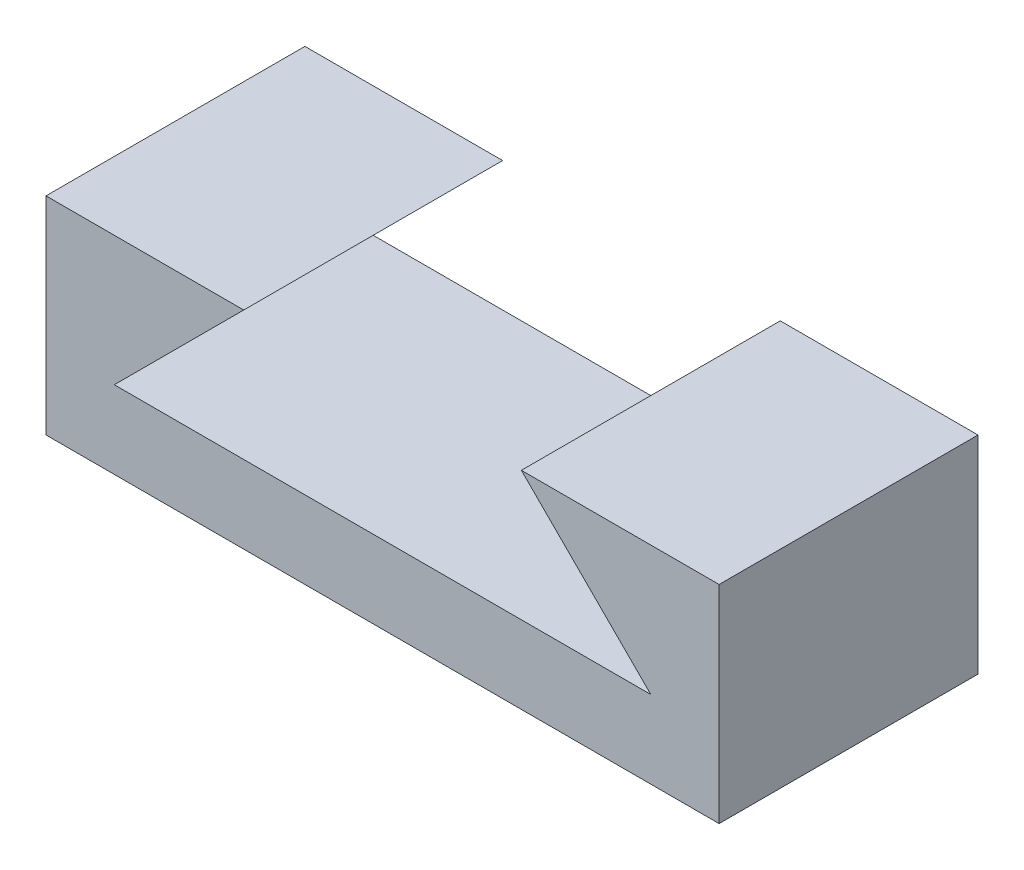
ISO-10303-21;
HEADER;
FILE_DESCRIPTION(('STEP AP214'),'2;1');
FILE_NAME('part.step','',(''),(''),'','','');
FILE_SCHEMA(('AUTOMOTIVE_DESIGN { 1 0 10303 214 1 1 1 1 }'));
ENDSEC;
DATA;
#1=APPLICATION_CONTEXT('core data for automotive mechanical design processes');
#2=APPLICATION_PROTOCOL_DEFINITION('international standard','automotive_design',2000,#1);
#3=PRODUCT_CONTEXT('',#1,'mechanical');
#4=PRODUCT('Part','Part','',(#3));
#5=PRODUCT_RELATED_PRODUCT_CATEGORY('part','',(#4));
#6=PRODUCT_DEFINITION_FORMATION('','',#4);
#7=PRODUCT_DEFINITION_CONTEXT('part definition',#1,'design');
#8=PRODUCT_DEFINITION('design','',#6,#7);
#9=PRODUCT_DEFINITION_SHAPE('','',#8);
#10=(LENGTH_UNIT() NAMED_UNIT(*) SI_UNIT(.MILLI.,.METRE.));
#11=(NAMED_UNIT(*) PLANE_ANGLE_UNIT() SI_UNIT($,.RADIAN.));
#12=(NAMED_UNIT(*) SI_UNIT($,.STERADIAN.) SOLID_ANGLE_UNIT());
#13=UNCERTAINTY_MEASURE_WITH_UNIT(LENGTH_MEASURE(1.E-05),#10,'distance_accuracy_value','');
#14=(GEOMETRIC_REPRESENTATION_CONTEXT(3) GLOBAL_UNCERTAINTY_ASSIGNED_CONTEXT((#13)) GLOBAL_UNIT_ASSIGNED_CONTEXT((#10,
#11,#12)) REPRESENTATION_CONTEXT('',''));
#15=CARTESIAN_POINT('',(0.,0.,0.));
#16=DIRECTION('',(0.,0.,1.));
#17=DIRECTION('',(1.,0.,0.));
#18=AXIS2_PLACEMENT_3D('',#15,#16,#17);
#19=CARTESIAN_POINT('',(-13.2972618422205,0.464840425531962,10.));
#20=DIRECTION('',(1.,0.,0.));
#21=DIRECTION('',(0.,0.,-1.));
#22=AXIS2_PLACEMENT_3D('',#19,#20,#21);
#23=PLANE('',#22);
#24=DIRECTION('',(0.,-1.,0.));
#25=VECTOR('',#24,1.);
#26=CARTESIAN_POINT('',(-13.2972618422205,0.464840425531962,0.));
#27=LINE('',#26,#25);
#28=CARTESIAN_POINT('',(-13.2972618422205,0.464840425531962,0.));
#29=VERTEX_POINT('',#28);
#30=CARTESIAN_POINT('',(-13.2972618422205,-7.53515957446813,0.));
#31=VERTEX_POINT('',#30);
#32=EDGE_CURVE('E133',#29,#31,#27,.T.);
#33=ORIENTED_EDGE('',*,*,#32,.T.);
#34=DIRECTION('',(0.,0.,-1.));
#35=VECTOR('',#34,1.);
#36=CARTESIAN_POINT('',(-13.2972618422205,-7.53515957446813,10.));
#37=LINE('',#36,#35);
#38=CARTESIAN_POINT('',(-13.2972618422205,-7.53515957446813,10.));
#39=VERTEX_POINT('',#38);
#40=EDGE_CURVE('E41',#39,#31,#37,.T.);
#41=ORIENTED_EDGE('',*,*,#40,.F.);
#42=DIRECTION('',(0.,-1.,0.));
#43=VECTOR('',#42,1.);
#44=CARTESIAN_POINT('',(-13.2972618422205,0.464840425531962,10.));
#45=LINE('',#44,#43);
#46=CARTESIAN_POINT('',(-13.2972618422205,0.464840425531962,10.));
#47=VERTEX_POINT('',#46);
#48=EDGE_CURVE('E93',#47,#39,#45,.T.);
#49=ORIENTED_EDGE('',*,*,#48,.F.);
#50=DIRECTION('',(0.,0.,-1.));
#51=VECTOR('',#50,1.);
#52=CARTESIAN_POINT('',(-13.2972618422205,0.464840425531962,10.));
#53=LINE('',#52,#51);
#54=EDGE_CURVE('E11',#47,#29,#53,.T.);
#55=ORIENTED_EDGE('',*,*,#54,.T.);
#56=EDGE_LOOP('',(#33,#41,#49,#55));
#57=FACE_BOUND('',#56,.T.);
#58=ADVANCED_FACE('F33',(#57),#23,.F.);
#59=CARTESIAN_POINT('',(-13.2972618422205,-7.53515957446813,10.));
#60=DIRECTION('',(0.,1.,0.));
#61=DIRECTION('',(-1.,0.,0.));
#62=AXIS2_PLACEMENT_3D('',#59,#60,#61);
#63=PLANE('',#62);
#64=DIRECTION('',(1.,0.,0.));
#65=VECTOR('',#64,1.);
#66=CARTESIAN_POINT('',(-13.2972618422205,-7.53515957446813,0.));
#67=LINE('',#66,#65);
#68=CARTESIAN_POINT('',(12.7027381577795,-7.53515957446817,0.));
#69=VERTEX_POINT('',#68);
#70=EDGE_CURVE('E135',#31,#69,#67,.T.);
#71=ORIENTED_EDGE('',*,*,#70,.T.);
#72=DIRECTION('',(0.,0.,-1.));
#73=VECTOR('',#72,1.);
#74=CARTESIAN_POINT('',(12.7027381577795,-7.53515957446817,10.));
#75=LINE('',#74,#73);
#76=CARTESIAN_POINT('',(12.7027381577795,-7.53515957446817,10.));
#77=VERTEX_POINT('',#76);
#78=EDGE_CURVE('E153',#77,#69,#75,.T.);
#79=ORIENTED_EDGE('',*,*,#78,.F.);
#80=DIRECTION('',(1.,0.,0.));
#81=VECTOR('',#80,1.);
#82=CARTESIAN_POINT('',(-13.2972618422205,-7.53515957446813,10.));
#83=LINE('',#82,#81);
#84=EDGE_CURVE('E161',#39,#77,#83,.T.);
#85=ORIENTED_EDGE('',*,*,#84,.F.);
#86=ORIENTED_EDGE('',*,*,#40,.T.);
#87=EDGE_LOOP('',(#71,#79,#85,#86));
#88=FACE_BOUND('',#87,.T.);
#89=ADVANCED_FACE('F159',(#88),#63,.F.);
#90=CARTESIAN_POINT('',(12.7027381577795,0.464840425531919,10.));
#91=DIRECTION('',(-1.,0.,0.));
#92=DIRECTION('',(0.,-1.,0.));
#93=AXIS2_PLACEMENT_3D('',#90,#91,#92);
#94=PLANE('',#93);
#95=DIRECTION('',(0.,1.,0.));
#96=VECTOR('',#95,1.);
#97=CARTESIAN_POINT('',(12.7027381577795,0.464840425531919,0.));
#98=LINE('',#97,#96);
#99=CARTESIAN_POINT('',(12.7027381577795,0.464840425531919,0.));
#100=VERTEX_POINT('',#99);
#101=EDGE_CURVE('E137',#69,#100,#98,.T.);
#102=ORIENTED_EDGE('',*,*,#101,.T.);
#103=DIRECTION('',(0.,0.,-1.));
#104=VECTOR('',#103,1.);
#105=CARTESIAN_POINT('',(12.7027381577795,0.464840425531919,10.));
#106=LINE('',#105,#104);
#107=CARTESIAN_POINT('',(12.7027381577795,0.464840425531919,10.));
#108=VERTEX_POINT('',#107);
#109=EDGE_CURVE('E150',#108,#100,#106,.T.);
#110=ORIENTED_EDGE('',*,*,#109,.F.);
#111=DIRECTION('',(0.,1.,0.));
#112=VECTOR('',#111,1.);
#113=CARTESIAN_POINT('',(12.7027381577795,0.464840425531919,10.));
#114=LINE('',#113,#112);
#115=EDGE_CURVE('E173',#77,#108,#114,.T.);
#116=ORIENTED_EDGE('',*,*,#115,.F.);
#117=ORIENTED_EDGE('',*,*,#78,.T.);
#118=EDGE_LOOP('',(#102,#110,#116,#117));
#119=FACE_BOUND('',#118,.T.);
#120=ADVANCED_FACE('F169',(#119),#94,.F.);
#121=CARTESIAN_POINT('',(5.06487019213531,0.464840425531919,10.));
#122=DIRECTION('',(0.,-1.,0.));
#123=DIRECTION('',(1.,0.,0.));
#124=AXIS2_PLACEMENT_3D('',#121,#122,#123);
#125=PLANE('',#124);
#126=DIRECTION('',(-1.,0.,0.));
#127=VECTOR('',#126,1.);
#128=CARTESIAN_POINT('',(5.06487019213531,0.464840425531919,0.));
#129=LINE('',#128,#127);
#130=CARTESIAN_POINT('',(5.06487019213531,0.464840425531919,0.));
#131=VERTEX_POINT('',#130);
#132=EDGE_CURVE('E140',#100,#131,#129,.T.);
#133=ORIENTED_EDGE('',*,*,#132,.T.);
#134=DIRECTION('',(0.,0.,-1.));
#135=VECTOR('',#134,1.);
#136=CARTESIAN_POINT('',(5.06487019213531,0.464840425531919,10.));
#137=LINE('',#136,#135);
#138=CARTESIAN_POINT('',(5.06487019213531,0.464840425531919,10.));
#139=VERTEX_POINT('',#138);
#140=EDGE_CURVE('E122',#139,#131,#137,.T.);
#141=ORIENTED_EDGE('',*,*,#140,.F.);
#142=DIRECTION('',(-1.,0.,0.));
#143=VECTOR('',#142,1.);
#144=CARTESIAN_POINT('',(9.70273815777952,0.464840425531962,10.));
#145=LINE('',#144,#143);
#146=EDGE_CURVE('E113',#108,#139,#145,.T.);
#147=ORIENTED_EDGE('',*,*,#146,.F.);
#148=ORIENTED_EDGE('',*,*,#109,.T.);
#149=EDGE_LOOP('',(#133,#141,#147,#148));
#150=FACE_BOUND('',#149,.T.);
#151=ADVANCED_FACE('F172',(#150),#125,.F.);
#152=CARTESIAN_POINT('',(10.0648701921355,-4.53515957446817,10.));
#153=DIRECTION('',(0.707106781186542,0.707106781186554,0.));
#154=DIRECTION('',(-0.707106781186554,0.707106781186542,0.));
#155=AXIS2_PLACEMENT_3D('',#152,#153,#154);
#156=PLANE('',#155);
#157=DIRECTION('',(0.707106781186554,-0.707106781186542,0.));
#158=VECTOR('',#157,1.);
#159=CARTESIAN_POINT('',(10.0648701921355,-4.53515957446817,0.));
#160=LINE('',#159,#158);
#161=CARTESIAN_POINT('',(10.0648701921355,-4.53515957446817,0.));
#162=VERTEX_POINT('',#161);
#163=EDGE_CURVE('E121',#131,#162,#160,.T.);
#164=ORIENTED_EDGE('',*,*,#163,.T.);
#165=DIRECTION('',(0.,0.,-1.));
#166=VECTOR('',#165,1.);
#167=CARTESIAN_POINT('',(10.0648701921355,-4.53515957446817,10.));
#168=LINE('',#167,#166);
#169=CARTESIAN_POINT('',(10.0648701921355,-4.53515957446817,10.));
#170=VERTEX_POINT('',#169);
#171=EDGE_CURVE('E118',#170,#162,#168,.T.);
#172=ORIENTED_EDGE('',*,*,#171,.F.);
#173=DIRECTION('',(0.707106781186554,-0.707106781186542,0.));
#174=VECTOR('',#173,1.);
#175=CARTESIAN_POINT('',(10.0648701921355,-4.53515957446817,10.));
#176=LINE('',#175,#174);
#177=EDGE_CURVE('E107',#139,#170,#176,.T.);
#178=ORIENTED_EDGE('',*,*,#177,.F.);
#179=ORIENTED_EDGE('',*,*,#140,.T.);
#180=EDGE_LOOP('',(#164,#172,#178,#179));
#181=FACE_BOUND('',#180,.T.);
#182=ADVANCED_FACE('F119',(#181),#156,.F.);
#183=CARTESIAN_POINT('',(-10.6593938765765,-4.53515957446813,10.));
#184=DIRECTION('',(0.,-1.,0.));
#185=DIRECTION('',(1.,0.,0.));
#186=AXIS2_PLACEMENT_3D('',#183,#184,#185);
#187=PLANE('',#186);
#188=DIRECTION('',(-1.,0.,0.));
#189=VECTOR('',#188,1.);
#190=CARTESIAN_POINT('',(-10.6593938765765,-4.53515957446813,0.));
#191=LINE('',#190,#189);
#192=CARTESIAN_POINT('',(-10.6593938765765,-4.53515957446813,0.));
#193=VERTEX_POINT('',#192);
#194=EDGE_CURVE('E79',#162,#193,#191,.T.);
#195=ORIENTED_EDGE('',*,*,#194,.T.);
#196=DIRECTION('',(0.,0.,-1.));
#197=VECTOR('',#196,1.);
#198=CARTESIAN_POINT('',(-10.6593938765765,-4.53515957446813,10.));
#199=LINE('',#198,#197);
#200=CARTESIAN_POINT('',(-10.6593938765765,-4.53515957446813,10.));
#201=VERTEX_POINT('',#200);
#202=EDGE_CURVE('E123',#201,#193,#199,.T.);
#203=ORIENTED_EDGE('',*,*,#202,.F.);
#204=DIRECTION('',(-1.,0.,0.));
#205=VECTOR('',#204,1.);
#206=CARTESIAN_POINT('',(-10.6593938765765,-4.53515957446813,10.));
#207=LINE('',#206,#205);
#208=EDGE_CURVE('E111',#170,#201,#207,.T.);
#209=ORIENTED_EDGE('',*,*,#208,.F.);
#210=ORIENTED_EDGE('',*,*,#171,.T.);
#211=EDGE_LOOP('',(#195,#203,#209,#210));
#212=FACE_BOUND('',#211,.T.);
#213=ADVANCED_FACE('F125',(#212),#187,.F.);
#214=CARTESIAN_POINT('',(-5.65939387657646,0.464840425531962,10.));
#215=DIRECTION('',(-0.707106781186548,0.707106781186547,0.));
#216=DIRECTION('',(-0.707106781186547,-0.707106781186548,0.));
#217=AXIS2_PLACEMENT_3D('',#214,#215,#216);
#218=PLANE('',#217);
#219=DIRECTION('',(0.707106781186547,0.707106781186548,0.));
#220=VECTOR('',#219,1.);
#221=CARTESIAN_POINT('',(-5.65939387657646,0.464840425531962,0.));
#222=LINE('',#221,#220);
#223=CARTESIAN_POINT('',(-5.65939387657646,0.464840425531962,0.));
#224=VERTEX_POINT('',#223);
#225=EDGE_CURVE('E86',#193,#224,#222,.T.);
#226=ORIENTED_EDGE('',*,*,#225,.T.);
#227=DIRECTION('',(0.,0.,-1.));
#228=VECTOR('',#227,1.);
#229=CARTESIAN_POINT('',(-5.65939387657646,0.464840425531962,10.));
#230=LINE('',#229,#228);
#231=CARTESIAN_POINT('',(-5.65939387657646,0.464840425531962,10.));
#232=VERTEX_POINT('',#231);
#233=EDGE_CURVE('E129',#232,#224,#230,.T.);
#234=ORIENTED_EDGE('',*,*,#233,.F.);
#235=DIRECTION('',(0.707106781186547,0.707106781186548,0.));
#236=VECTOR('',#235,1.);
#237=CARTESIAN_POINT('',(-5.65939387657646,0.464840425531962,10.));
#238=LINE('',#237,#236);
#239=EDGE_CURVE('E127',#201,#232,#238,.T.);
#240=ORIENTED_EDGE('',*,*,#239,.F.);
#241=ORIENTED_EDGE('',*,*,#202,.T.);
#242=EDGE_LOOP('',(#226,#234,#240,#241));
#243=FACE_BOUND('',#242,.T.);
#244=ADVANCED_FACE('F194',(#243),#218,.F.);
#245=CARTESIAN_POINT('',(-10.2972618422205,0.464840425531962,10.));
#246=DIRECTION('',(0.,-1.,0.));
#247=DIRECTION('',(0.,0.,-1.));
#248=AXIS2_PLACEMENT_3D('',#245,#246,#247);
#249=PLANE('',#248);
#250=DIRECTION('',(-1.,0.,0.));
#251=VECTOR('',#250,1.);
#252=CARTESIAN_POINT('',(-10.2972618422205,0.464840425531962,0.));
#253=LINE('',#252,#251);
#254=EDGE_CURVE('E145',#224,#29,#253,.T.);
#255=ORIENTED_EDGE('',*,*,#254,.T.);
#256=ORIENTED_EDGE('',*,*,#54,.F.);
#257=DIRECTION('',(-1.,0.,0.));
#258=VECTOR('',#257,1.);
#259=CARTESIAN_POINT('',(-10.2972618422205,0.464840425531962,10.));
#260=LINE('',#259,#258);
#261=EDGE_CURVE('E49',#232,#47,#260,.T.);
#262=ORIENTED_EDGE('',*,*,#261,.F.);
#263=ORIENTED_EDGE('',*,*,#233,.T.);
#264=EDGE_LOOP('',(#255,#256,#262,#263));
#265=FACE_BOUND('',#264,.T.);
#266=ADVANCED_FACE('F178',(#265),#249,.F.);
#267=CARTESIAN_POINT('',(0.,0.,10.));
#268=DIRECTION('',(0.,0.,1.));
#269=DIRECTION('',(1.,0.,0.));
#270=AXIS2_PLACEMENT_3D('',#267,#268,#269);
#271=PLANE('',#270);
#272=ORIENTED_EDGE('',*,*,#261,.T.);
#273=ORIENTED_EDGE('',*,*,#48,.T.);
#274=ORIENTED_EDGE('',*,*,#84,.T.);
#275=ORIENTED_EDGE('',*,*,#115,.T.);
#276=ORIENTED_EDGE('',*,*,#146,.T.);
#277=ORIENTED_EDGE('',*,*,#177,.T.);
#278=ORIENTED_EDGE('',*,*,#208,.T.);
#279=ORIENTED_EDGE('',*,*,#239,.T.);
#280=EDGE_LOOP('',(#272,#273,#274,#275,#276,#277,#278,#279));
#281=FACE_BOUND('',#280,.T.);
#282=ADVANCED_FACE('F109',(#281),#271,.T.);
#283=CARTESIAN_POINT('',(0.,0.,0.));
#284=DIRECTION('',(0.,0.,1.));
#285=DIRECTION('',(1.,0.,0.));
#286=AXIS2_PLACEMENT_3D('',#283,#284,#285);
#287=PLANE('',#286);
#288=ORIENTED_EDGE('',*,*,#32,.F.);
#289=ORIENTED_EDGE('',*,*,#254,.F.);
#290=ORIENTED_EDGE('',*,*,#225,.F.);
#291=ORIENTED_EDGE('',*,*,#194,.F.);
#292=ORIENTED_EDGE('',*,*,#163,.F.);
#293=ORIENTED_EDGE('',*,*,#132,.F.);
#294=ORIENTED_EDGE('',*,*,#101,.F.);
#295=ORIENTED_EDGE('',*,*,#70,.F.);
#296=EDGE_LOOP('',(#288,#289,#290,#291,#292,#293,#294,#295));
#297=FACE_BOUND('',#296,.T.);
#298=ADVANCED_FACE('F165',(#297),#287,.F.);
#299=CLOSED_SHELL('',(#58,#89,#120,#151,#182,#213,#244,#266,#282,#298));
#300=MANIFOLD_SOLID_BREP('B2',#299);
#301=ADVANCED_BREP_SHAPE_REPRESENTATION('',(#18,#300),#14);
#302=SHAPE_DEFINITION_REPRESENTATION(#9,#301);
ENDSEC;
END-ISO-10303-21;
